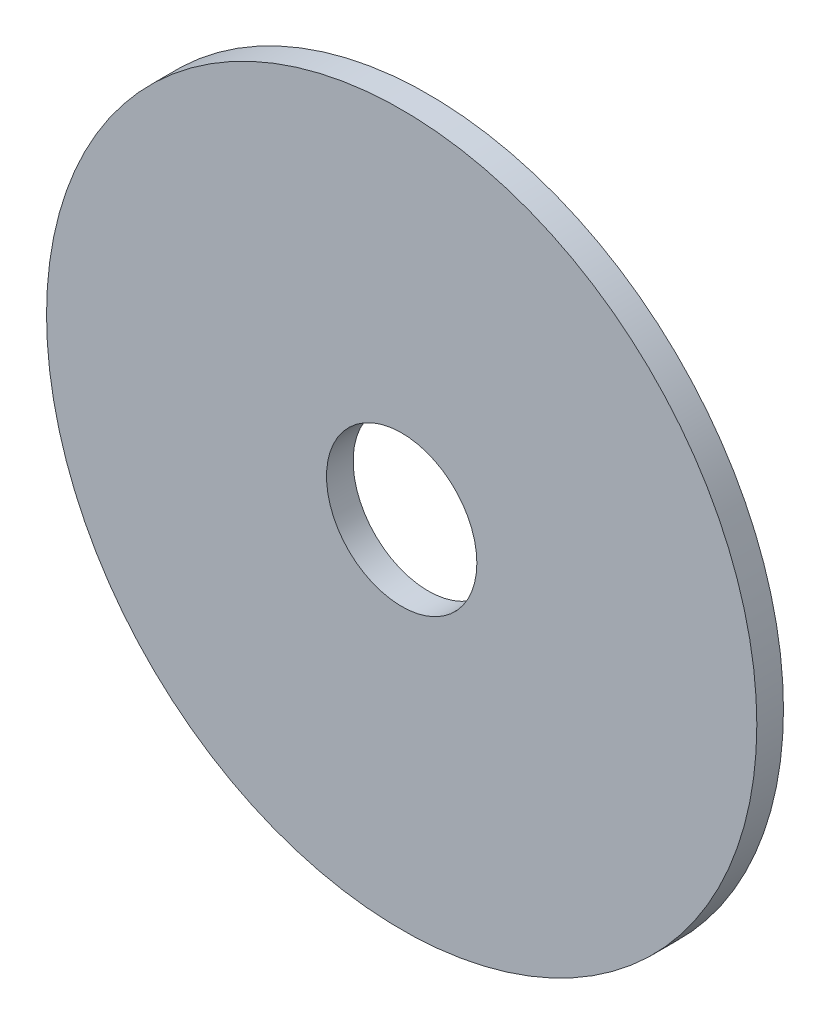
ISO-10303-21;
HEADER;
FILE_DESCRIPTION(('STEP AP214'),'2;1');
FILE_NAME('part.step','',(''),(''),'','','');
FILE_SCHEMA(('AUTOMOTIVE_DESIGN { 1 0 10303 214 1 1 1 1 }'));
ENDSEC;
DATA;
#1=APPLICATION_CONTEXT('core data for automotive mechanical design processes');
#2=APPLICATION_PROTOCOL_DEFINITION('international standard','automotive_design',2000,#1);
#3=PRODUCT_CONTEXT('',#1,'mechanical');
#4=PRODUCT('Part','Part','',(#3));
#5=PRODUCT_RELATED_PRODUCT_CATEGORY('part','',(#4));
#6=PRODUCT_DEFINITION_FORMATION('','',#4);
#7=PRODUCT_DEFINITION_CONTEXT('part definition',#1,'design');
#8=PRODUCT_DEFINITION('design','',#6,#7);
#9=PRODUCT_DEFINITION_SHAPE('','',#8);
#10=(LENGTH_UNIT() NAMED_UNIT(*) SI_UNIT(.MILLI.,.METRE.));
#11=(NAMED_UNIT(*) PLANE_ANGLE_UNIT() SI_UNIT($,.RADIAN.));
#12=(NAMED_UNIT(*) SI_UNIT($,.STERADIAN.) SOLID_ANGLE_UNIT());
#13=UNCERTAINTY_MEASURE_WITH_UNIT(LENGTH_MEASURE(1.E-05),#10,'distance_accuracy_value','');
#14=(GEOMETRIC_REPRESENTATION_CONTEXT(3) GLOBAL_UNCERTAINTY_ASSIGNED_CONTEXT((#13)) GLOBAL_UNIT_ASSIGNED_CONTEXT((#10,
#11,#12)) REPRESENTATION_CONTEXT('',''));
#15=CARTESIAN_POINT('',(0.,0.,0.));
#16=DIRECTION('',(0.,0.,1.));
#17=DIRECTION('',(1.,0.,0.));
#18=AXIS2_PLACEMENT_3D('',#15,#16,#17);
#19=CARTESIAN_POINT('',(0.,0.,4.5));
#20=DIRECTION('',(0.,0.,1.));
#21=DIRECTION('',(1.,0.,0.));
#22=AXIS2_PLACEMENT_3D('',#19,#20,#21);
#23=PLANE('',#22);
#24=CARTESIAN_POINT('',(0.,0.,4.5));
#25=DIRECTION('',(0.,0.,1.));
#26=DIRECTION('',(1.,0.,0.));
#27=AXIS2_PLACEMENT_3D('',#24,#25,#26);
#28=CIRCLE('',#27,60.);
#29=CARTESIAN_POINT('',(60.,0.,4.5));
#30=VERTEX_POINT('',#29);
#31=EDGE_CURVE('E10',#30,#30,#28,.T.);
#32=ORIENTED_EDGE('',*,*,#31,.T.);
#33=EDGE_LOOP('',(#32));
#34=FACE_BOUND('',#33,.T.);
#35=CARTESIAN_POINT('',(0.,0.,4.5));
#36=DIRECTION('',(0.,0.,1.));
#37=DIRECTION('',(1.,0.,0.));
#38=AXIS2_PLACEMENT_3D('',#35,#36,#37);
#39=CIRCLE('',#38,12.7);
#40=CARTESIAN_POINT('',(12.7,0.,4.5));
#41=VERTEX_POINT('',#40);
#42=EDGE_CURVE('E39',#41,#41,#39,.T.);
#43=ORIENTED_EDGE('',*,*,#42,.F.);
#44=EDGE_LOOP('',(#43));
#45=FACE_BOUND('',#44,.T.);
#46=ADVANCED_FACE('F28',(#34,#45),#23,.T.);
#47=CARTESIAN_POINT('',(0.,0.,0.));
#48=DIRECTION('',(0.,0.,1.));
#49=DIRECTION('',(1.,0.,0.));
#50=AXIS2_PLACEMENT_3D('',#47,#48,#49);
#51=PLANE('',#50);
#52=CARTESIAN_POINT('',(0.,0.,0.));
#53=DIRECTION('',(0.,0.,1.));
#54=DIRECTION('',(1.,0.,0.));
#55=AXIS2_PLACEMENT_3D('',#52,#53,#54);
#56=CIRCLE('',#55,60.);
#57=CARTESIAN_POINT('',(60.,0.,0.));
#58=VERTEX_POINT('',#57);
#59=EDGE_CURVE('E32',#58,#58,#56,.T.);
#60=ORIENTED_EDGE('',*,*,#59,.F.);
#61=EDGE_LOOP('',(#60));
#62=FACE_BOUND('',#61,.T.);
#63=CARTESIAN_POINT('',(0.,0.,0.));
#64=DIRECTION('',(0.,0.,1.));
#65=DIRECTION('',(1.,0.,0.));
#66=AXIS2_PLACEMENT_3D('',#63,#64,#65);
#67=CIRCLE('',#66,12.7);
#68=CARTESIAN_POINT('',(12.7,0.,0.));
#69=VERTEX_POINT('',#68);
#70=EDGE_CURVE('E41',#69,#69,#67,.T.);
#71=ORIENTED_EDGE('',*,*,#70,.T.);
#72=EDGE_LOOP('',(#71));
#73=FACE_BOUND('',#72,.T.);
#74=ADVANCED_FACE('F51',(#62,#73),#51,.F.);
#75=CARTESIAN_POINT('',(0.,0.,4.5));
#76=DIRECTION('',(0.,0.,-1.));
#77=DIRECTION('',(-1.,0.,0.));
#78=AXIS2_PLACEMENT_3D('',#75,#76,#77);
#79=CYLINDRICAL_SURFACE('',#78,60.);
#80=ORIENTED_EDGE('',*,*,#31,.F.);
#81=EDGE_LOOP('',(#80));
#82=FACE_BOUND('',#81,.T.);
#83=ORIENTED_EDGE('',*,*,#59,.T.);
#84=EDGE_LOOP('',(#83));
#85=FACE_BOUND('',#84,.T.);
#86=ADVANCED_FACE('F30',(#82,#85),#79,.T.);
#87=CARTESIAN_POINT('',(0.,0.,4.5));
#88=DIRECTION('',(0.,0.,-1.));
#89=DIRECTION('',(-1.,0.,0.));
#90=AXIS2_PLACEMENT_3D('',#87,#88,#89);
#91=CYLINDRICAL_SURFACE('',#90,12.7);
#92=ORIENTED_EDGE('',*,*,#42,.T.);
#93=EDGE_LOOP('',(#92));
#94=FACE_BOUND('',#93,.T.);
#95=ORIENTED_EDGE('',*,*,#70,.F.);
#96=EDGE_LOOP('',(#95));
#97=FACE_BOUND('',#96,.T.);
#98=ADVANCED_FACE('F47',(#94,#97),#91,.F.);
#99=CLOSED_SHELL('',(#46,#74,#86,#98));
#100=MANIFOLD_SOLID_BREP('B2',#99);
#101=ADVANCED_BREP_SHAPE_REPRESENTATION('',(#18,#100),#14);
#102=SHAPE_DEFINITION_REPRESENTATION(#9,#101);
ENDSEC;
END-ISO-10303-21;
